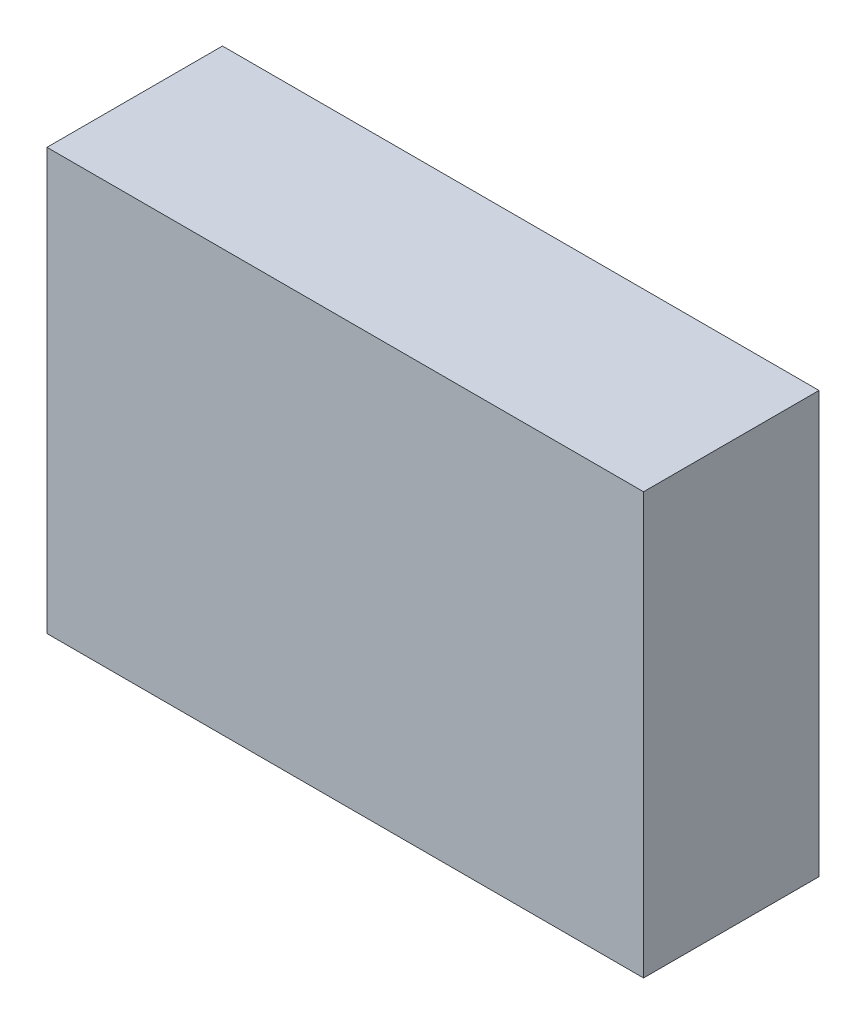
ISO-10303-21;
HEADER;
FILE_DESCRIPTION(('STEP AP214'),'2;1');
FILE_NAME('part.step','',(''),(''),'','','');
FILE_SCHEMA(('AUTOMOTIVE_DESIGN { 1 0 10303 214 1 1 1 1 }'));
ENDSEC;
DATA;
#1=APPLICATION_CONTEXT('core data for automotive mechanical design processes');
#2=APPLICATION_PROTOCOL_DEFINITION('international standard','automotive_design',2000,#1);
#3=PRODUCT_CONTEXT('',#1,'mechanical');
#4=PRODUCT('Part','Part','',(#3));
#5=PRODUCT_RELATED_PRODUCT_CATEGORY('part','',(#4));
#6=PRODUCT_DEFINITION_FORMATION('','',#4);
#7=PRODUCT_DEFINITION_CONTEXT('part definition',#1,'design');
#8=PRODUCT_DEFINITION('design','',#6,#7);
#9=PRODUCT_DEFINITION_SHAPE('','',#8);
#10=(LENGTH_UNIT() NAMED_UNIT(*) SI_UNIT(.MILLI.,.METRE.));
#11=(NAMED_UNIT(*) PLANE_ANGLE_UNIT() SI_UNIT($,.RADIAN.));
#12=(NAMED_UNIT(*) SI_UNIT($,.STERADIAN.) SOLID_ANGLE_UNIT());
#13=UNCERTAINTY_MEASURE_WITH_UNIT(LENGTH_MEASURE(1.E-05),#10,'distance_accuracy_value','');
#14=(GEOMETRIC_REPRESENTATION_CONTEXT(3) GLOBAL_UNCERTAINTY_ASSIGNED_CONTEXT((#13)) GLOBAL_UNIT_ASSIGNED_CONTEXT((#10,
#11,#12)) REPRESENTATION_CONTEXT('',''));
#15=CARTESIAN_POINT('',(0.,0.,0.));
#16=DIRECTION('',(0.,0.,1.));
#17=DIRECTION('',(1.,0.,0.));
#18=AXIS2_PLACEMENT_3D('',#15,#16,#17);
#19=CARTESIAN_POINT('',(-2.92,0.63,0.));
#20=DIRECTION('',(1.,0.,0.));
#21=DIRECTION('',(0.,0.,1.));
#22=AXIS2_PLACEMENT_3D('',#19,#20,#21);
#23=PLANE('',#22);
#24=DIRECTION('',(0.,1.,0.));
#25=VECTOR('',#24,1.);
#26=CARTESIAN_POINT('',(-2.92,0.63,0.1));
#27=LINE('',#26,#25);
#28=CARTESIAN_POINT('',(-2.92,0.63,0.1));
#29=VERTEX_POINT('',#28);
#30=CARTESIAN_POINT('',(-2.92,0.87,0.1));
#31=VERTEX_POINT('',#30);
#32=EDGE_CURVE('E11',#29,#31,#27,.T.);
#33=ORIENTED_EDGE('',*,*,#32,.T.);
#34=DIRECTION('',(0.,0.,1.));
#35=VECTOR('',#34,1.);
#36=CARTESIAN_POINT('',(-2.92,0.87,0.));
#37=LINE('',#36,#35);
#38=CARTESIAN_POINT('',(-2.92,0.87,0.));
#39=VERTEX_POINT('',#38);
#40=EDGE_CURVE('E24',#39,#31,#37,.T.);
#41=ORIENTED_EDGE('',*,*,#40,.F.);
#42=DIRECTION('',(0.,1.,0.));
#43=VECTOR('',#42,1.);
#44=CARTESIAN_POINT('',(-2.92,0.63,0.));
#45=LINE('',#44,#43);
#46=CARTESIAN_POINT('',(-2.92,0.63,0.));
#47=VERTEX_POINT('',#46);
#48=EDGE_CURVE('E86',#47,#39,#45,.T.);
#49=ORIENTED_EDGE('',*,*,#48,.F.);
#50=DIRECTION('',(0.,0.,1.));
#51=VECTOR('',#50,1.);
#52=CARTESIAN_POINT('',(-2.92,0.63,0.));
#53=LINE('',#52,#51);
#54=EDGE_CURVE('E36',#47,#29,#53,.T.);
#55=ORIENTED_EDGE('',*,*,#54,.T.);
#56=EDGE_LOOP('',(#33,#41,#49,#55));
#57=FACE_BOUND('',#56,.T.);
#58=ADVANCED_FACE('F17',(#57),#23,.F.);
#59=CARTESIAN_POINT('',(-2.58,0.63,0.));
#60=DIRECTION('',(1.,0.,0.));
#61=DIRECTION('',(0.,0.,1.));
#62=AXIS2_PLACEMENT_3D('',#59,#60,#61);
#63=PLANE('',#62);
#64=DIRECTION('',(0.,0.,1.));
#65=VECTOR('',#64,1.);
#66=CARTESIAN_POINT('',(-2.58,0.63,0.));
#67=LINE('',#66,#65);
#68=CARTESIAN_POINT('',(-2.58,0.63,0.));
#69=VERTEX_POINT('',#68);
#70=CARTESIAN_POINT('',(-2.58,0.63,0.1));
#71=VERTEX_POINT('',#70);
#72=EDGE_CURVE('E83',#69,#71,#67,.T.);
#73=ORIENTED_EDGE('',*,*,#72,.F.);
#74=DIRECTION('',(0.,1.,0.));
#75=VECTOR('',#74,1.);
#76=CARTESIAN_POINT('',(-2.58,0.63,0.));
#77=LINE('',#76,#75);
#78=CARTESIAN_POINT('',(-2.58,0.87,0.));
#79=VERTEX_POINT('',#78);
#80=EDGE_CURVE('E63',#69,#79,#77,.T.);
#81=ORIENTED_EDGE('',*,*,#80,.T.);
#82=DIRECTION('',(0.,0.,1.));
#83=VECTOR('',#82,1.);
#84=CARTESIAN_POINT('',(-2.58,0.87,0.));
#85=LINE('',#84,#83);
#86=CARTESIAN_POINT('',(-2.58,0.87,0.1));
#87=VERTEX_POINT('',#86);
#88=EDGE_CURVE('E57',#79,#87,#85,.T.);
#89=ORIENTED_EDGE('',*,*,#88,.T.);
#90=DIRECTION('',(0.,1.,0.));
#91=VECTOR('',#90,1.);
#92=CARTESIAN_POINT('',(-2.58,0.63,0.1));
#93=LINE('',#92,#91);
#94=EDGE_CURVE('E60',#71,#87,#93,.T.);
#95=ORIENTED_EDGE('',*,*,#94,.F.);
#96=EDGE_LOOP('',(#73,#81,#89,#95));
#97=FACE_BOUND('',#96,.T.);
#98=ADVANCED_FACE('F59',(#97),#63,.T.);
#99=CARTESIAN_POINT('',(-2.92,0.63,0.));
#100=DIRECTION('',(0.,1.,0.));
#101=DIRECTION('',(0.,0.,1.));
#102=AXIS2_PLACEMENT_3D('',#99,#100,#101);
#103=PLANE('',#102);
#104=ORIENTED_EDGE('',*,*,#72,.T.);
#105=DIRECTION('',(1.,0.,0.));
#106=VECTOR('',#105,1.);
#107=CARTESIAN_POINT('',(-2.92,0.63,0.1));
#108=LINE('',#107,#106);
#109=EDGE_CURVE('E71',#29,#71,#108,.T.);
#110=ORIENTED_EDGE('',*,*,#109,.F.);
#111=ORIENTED_EDGE('',*,*,#54,.F.);
#112=DIRECTION('',(1.,0.,0.));
#113=VECTOR('',#112,1.);
#114=CARTESIAN_POINT('',(-2.92,0.63,0.));
#115=LINE('',#114,#113);
#116=EDGE_CURVE('E76',#47,#69,#115,.T.);
#117=ORIENTED_EDGE('',*,*,#116,.T.);
#118=EDGE_LOOP('',(#104,#110,#111,#117));
#119=FACE_BOUND('',#118,.T.);
#120=ADVANCED_FACE('F91',(#119),#103,.F.);
#121=CARTESIAN_POINT('',(-2.92,0.87,0.));
#122=DIRECTION('',(0.,1.,0.));
#123=DIRECTION('',(0.,0.,1.));
#124=AXIS2_PLACEMENT_3D('',#121,#122,#123);
#125=PLANE('',#124);
#126=DIRECTION('',(1.,0.,0.));
#127=VECTOR('',#126,1.);
#128=CARTESIAN_POINT('',(-2.92,0.87,0.));
#129=LINE('',#128,#127);
#130=EDGE_CURVE('E74',#39,#79,#129,.T.);
#131=ORIENTED_EDGE('',*,*,#130,.F.);
#132=ORIENTED_EDGE('',*,*,#40,.T.);
#133=DIRECTION('',(1.,0.,0.));
#134=VECTOR('',#133,1.);
#135=CARTESIAN_POINT('',(-2.92,0.87,0.1));
#136=LINE('',#135,#134);
#137=EDGE_CURVE('E69',#31,#87,#136,.T.);
#138=ORIENTED_EDGE('',*,*,#137,.T.);
#139=ORIENTED_EDGE('',*,*,#88,.F.);
#140=EDGE_LOOP('',(#131,#132,#138,#139));
#141=FACE_BOUND('',#140,.T.);
#142=ADVANCED_FACE('F73',(#141),#125,.T.);
#143=CARTESIAN_POINT('',(-2.92,0.63,0.));
#144=DIRECTION('',(0.,0.,1.));
#145=DIRECTION('',(1.,0.,0.));
#146=AXIS2_PLACEMENT_3D('',#143,#144,#145);
#147=PLANE('',#146);
#148=ORIENTED_EDGE('',*,*,#130,.T.);
#149=ORIENTED_EDGE('',*,*,#80,.F.);
#150=ORIENTED_EDGE('',*,*,#116,.F.);
#151=ORIENTED_EDGE('',*,*,#48,.T.);
#152=EDGE_LOOP('',(#148,#149,#150,#151));
#153=FACE_BOUND('',#152,.T.);
#154=ADVANCED_FACE('F89',(#153),#147,.F.);
#155=CARTESIAN_POINT('',(-2.92,0.63,0.1));
#156=DIRECTION('',(0.,0.,1.));
#157=DIRECTION('',(1.,0.,0.));
#158=AXIS2_PLACEMENT_3D('',#155,#156,#157);
#159=PLANE('',#158);
#160=ORIENTED_EDGE('',*,*,#32,.F.);
#161=ORIENTED_EDGE('',*,*,#109,.T.);
#162=ORIENTED_EDGE('',*,*,#94,.T.);
#163=ORIENTED_EDGE('',*,*,#137,.F.);
#164=EDGE_LOOP('',(#160,#161,#162,#163));
#165=FACE_BOUND('',#164,.T.);
#166=ADVANCED_FACE('F68',(#165),#159,.T.);
#167=CLOSED_SHELL('',(#58,#98,#120,#142,#154,#166));
#168=MANIFOLD_SOLID_BREP('B1',#167);
#169=ADVANCED_BREP_SHAPE_REPRESENTATION('',(#18,#168),#14);
#170=SHAPE_DEFINITION_REPRESENTATION(#9,#169);
ENDSEC;
END-ISO-10303-21;
